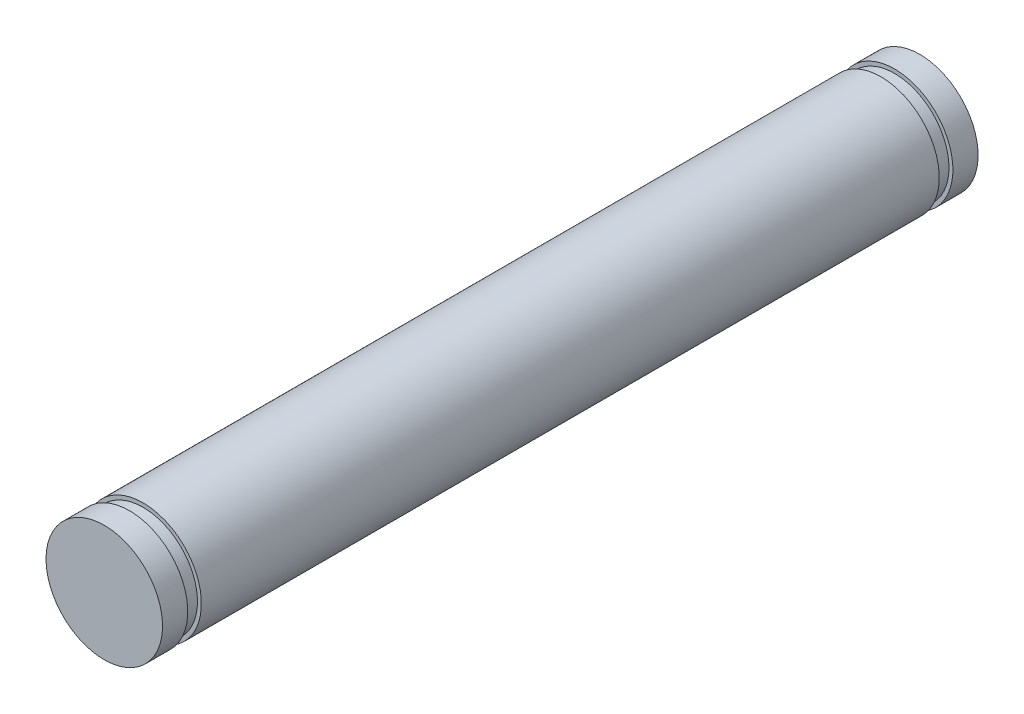
ISO-10303-21;
HEADER;
FILE_DESCRIPTION(('STEP AP214'),'2;1');
FILE_NAME('part.step','',(''),(''),'','','');
FILE_SCHEMA(('AUTOMOTIVE_DESIGN { 1 0 10303 214 1 1 1 1 }'));
ENDSEC;
DATA;
#1=APPLICATION_CONTEXT('core data for automotive mechanical design processes');
#2=APPLICATION_PROTOCOL_DEFINITION('international standard','automotive_design',2000,#1);
#3=PRODUCT_CONTEXT('',#1,'mechanical');
#4=PRODUCT('Part','Part','',(#3));
#5=PRODUCT_RELATED_PRODUCT_CATEGORY('part','',(#4));
#6=PRODUCT_DEFINITION_FORMATION('','',#4);
#7=PRODUCT_DEFINITION_CONTEXT('part definition',#1,'design');
#8=PRODUCT_DEFINITION('design','',#6,#7);
#9=PRODUCT_DEFINITION_SHAPE('','',#8);
#10=(LENGTH_UNIT() NAMED_UNIT(*) SI_UNIT(.MILLI.,.METRE.));
#11=(NAMED_UNIT(*) PLANE_ANGLE_UNIT() SI_UNIT($,.RADIAN.));
#12=(NAMED_UNIT(*) SI_UNIT($,.STERADIAN.) SOLID_ANGLE_UNIT());
#13=UNCERTAINTY_MEASURE_WITH_UNIT(LENGTH_MEASURE(1.E-05),#10,'distance_accuracy_value','');
#14=(GEOMETRIC_REPRESENTATION_CONTEXT(3) GLOBAL_UNCERTAINTY_ASSIGNED_CONTEXT((#13)) GLOBAL_UNIT_ASSIGNED_CONTEXT((#10,
#11,#12)) REPRESENTATION_CONTEXT('',''));
#15=CARTESIAN_POINT('',(0.,0.,0.));
#16=DIRECTION('',(0.,0.,1.));
#17=DIRECTION('',(1.,0.,0.));
#18=AXIS2_PLACEMENT_3D('',#15,#16,#17);
#19=CARTESIAN_POINT('',(0.,0.,42.));
#20=DIRECTION('',(0.,0.,1.));
#21=DIRECTION('',(1.,0.,0.));
#22=AXIS2_PLACEMENT_3D('',#19,#20,#21);
#23=PLANE('',#22);
#24=CARTESIAN_POINT('',(0.,0.,42.));
#25=DIRECTION('',(0.,0.,-1.));
#26=DIRECTION('',(-1.,0.,0.));
#27=AXIS2_PLACEMENT_3D('',#24,#25,#26);
#28=CIRCLE('',#27,3.);
#29=CARTESIAN_POINT('',(-3.,0.,42.));
#30=VERTEX_POINT('',#29);
#31=EDGE_CURVE('E18',#30,#30,#28,.T.);
#32=ORIENTED_EDGE('',*,*,#31,.F.);
#33=EDGE_LOOP('',(#32));
#34=FACE_BOUND('',#33,.T.);
#35=ADVANCED_FACE('F15',(#34),#23,.T.);
#36=CARTESIAN_POINT('',(0.,0.,0.));
#37=DIRECTION('',(0.,0.,1.));
#38=DIRECTION('',(1.,0.,0.));
#39=AXIS2_PLACEMENT_3D('',#36,#37,#38);
#40=PLANE('',#39);
#41=CARTESIAN_POINT('',(0.,0.,0.));
#42=DIRECTION('',(0.,0.,-1.));
#43=DIRECTION('',(-1.,0.,0.));
#44=AXIS2_PLACEMENT_3D('',#41,#42,#43);
#45=CIRCLE('',#44,3.);
#46=CARTESIAN_POINT('',(-3.,0.,0.));
#47=VERTEX_POINT('',#46);
#48=EDGE_CURVE('E46',#47,#47,#45,.F.);
#49=ORIENTED_EDGE('',*,*,#48,.F.);
#50=EDGE_LOOP('',(#49));
#51=FACE_BOUND('',#50,.T.);
#52=ADVANCED_FACE('F57',(#51),#40,.F.);
#53=CARTESIAN_POINT('',(0.,0.,42.));
#54=DIRECTION('',(0.,0.,-1.));
#55=DIRECTION('',(-1.,0.,0.));
#56=AXIS2_PLACEMENT_3D('',#53,#54,#55);
#57=CYLINDRICAL_SURFACE('',#56,3.);
#58=ORIENTED_EDGE('',*,*,#31,.T.);
#59=EDGE_LOOP('',(#58));
#60=FACE_BOUND('',#59,.T.);
#61=CARTESIAN_POINT('',(0.,0.,40.7));
#62=DIRECTION('',(0.,0.,-1.));
#63=DIRECTION('',(-1.,0.,0.));
#64=AXIS2_PLACEMENT_3D('',#61,#62,#63);
#65=CIRCLE('',#64,3.);
#66=CARTESIAN_POINT('',(-3.,0.,40.7));
#67=VERTEX_POINT('',#66);
#68=EDGE_CURVE('E44',#67,#67,#65,.T.);
#69=ORIENTED_EDGE('',*,*,#68,.F.);
#70=EDGE_LOOP('',(#69));
#71=FACE_BOUND('',#70,.T.);
#72=ADVANCED_FACE('F53',(#60,#71),#57,.T.);
#73=CARTESIAN_POINT('',(0.,0.,42.));
#74=DIRECTION('',(0.,0.,-1.));
#75=DIRECTION('',(-1.,0.,0.));
#76=AXIS2_PLACEMENT_3D('',#73,#74,#75);
#77=CYLINDRICAL_SURFACE('',#76,3.);
#78=CARTESIAN_POINT('',(0.,0.,1.3));
#79=DIRECTION('',(0.,0.,-1.));
#80=DIRECTION('',(-1.,0.,0.));
#81=AXIS2_PLACEMENT_3D('',#78,#79,#80);
#82=CIRCLE('',#81,3.);
#83=CARTESIAN_POINT('',(-3.,0.,1.3));
#84=VERTEX_POINT('',#83);
#85=EDGE_CURVE('E41',#84,#84,#82,.F.);
#86=ORIENTED_EDGE('',*,*,#85,.F.);
#87=EDGE_LOOP('',(#86));
#88=FACE_BOUND('',#87,.T.);
#89=ORIENTED_EDGE('',*,*,#48,.T.);
#90=EDGE_LOOP('',(#89));
#91=FACE_BOUND('',#90,.T.);
#92=ADVANCED_FACE('F93',(#88,#91),#77,.T.);
#93=CARTESIAN_POINT('',(3.,0.,40.7));
#94=DIRECTION('',(0.,0.,-1.));
#95=DIRECTION('',(-1.,0.,0.));
#96=AXIS2_PLACEMENT_3D('',#93,#94,#95);
#97=PLANE('',#96);
#98=CARTESIAN_POINT('',(0.,0.,40.7));
#99=DIRECTION('',(0.,0.,-1.));
#100=DIRECTION('',(-1.,0.,0.));
#101=AXIS2_PLACEMENT_3D('',#98,#99,#100);
#102=CIRCLE('',#101,2.8);
#103=CARTESIAN_POINT('',(-2.8,0.,40.7));
#104=VERTEX_POINT('',#103);
#105=EDGE_CURVE('E38',#104,#104,#102,.T.);
#106=ORIENTED_EDGE('',*,*,#105,.F.);
#107=EDGE_LOOP('',(#106));
#108=FACE_BOUND('',#107,.T.);
#109=ORIENTED_EDGE('',*,*,#68,.T.);
#110=EDGE_LOOP('',(#109));
#111=FACE_BOUND('',#110,.T.);
#112=ADVANCED_FACE('F89',(#108,#111),#97,.T.);
#113=CARTESIAN_POINT('',(3.,0.,1.3));
#114=DIRECTION('',(0.,0.,1.));
#115=DIRECTION('',(1.,0.,0.));
#116=AXIS2_PLACEMENT_3D('',#113,#114,#115);
#117=PLANE('',#116);
#118=ORIENTED_EDGE('',*,*,#85,.T.);
#119=EDGE_LOOP('',(#118));
#120=FACE_BOUND('',#119,.T.);
#121=CARTESIAN_POINT('',(0.,0.,1.3));
#122=DIRECTION('',(0.,0.,-1.));
#123=DIRECTION('',(-1.,0.,0.));
#124=AXIS2_PLACEMENT_3D('',#121,#122,#123);
#125=CIRCLE('',#124,2.8);
#126=CARTESIAN_POINT('',(-2.8,0.,1.3));
#127=VERTEX_POINT('',#126);
#128=EDGE_CURVE('E35',#127,#127,#125,.F.);
#129=ORIENTED_EDGE('',*,*,#128,.F.);
#130=EDGE_LOOP('',(#129));
#131=FACE_BOUND('',#130,.T.);
#132=ADVANCED_FACE('F85',(#120,#131),#117,.T.);
#133=CARTESIAN_POINT('',(0.,0.,0.));
#134=DIRECTION('',(0.,0.,-1.));
#135=DIRECTION('',(-1.,0.,0.));
#136=AXIS2_PLACEMENT_3D('',#133,#134,#135);
#137=CYLINDRICAL_SURFACE('',#136,2.8);
#138=ORIENTED_EDGE('',*,*,#105,.T.);
#139=EDGE_LOOP('',(#138));
#140=FACE_BOUND('',#139,.T.);
#141=CARTESIAN_POINT('',(0.,0.,40.));
#142=DIRECTION('',(0.,0.,-1.));
#143=DIRECTION('',(-1.,0.,0.));
#144=AXIS2_PLACEMENT_3D('',#141,#142,#143);
#145=CIRCLE('',#144,2.8);
#146=CARTESIAN_POINT('',(-2.8,0.,40.));
#147=VERTEX_POINT('',#146);
#148=EDGE_CURVE('E32',#147,#147,#145,.T.);
#149=ORIENTED_EDGE('',*,*,#148,.F.);
#150=EDGE_LOOP('',(#149));
#151=FACE_BOUND('',#150,.T.);
#152=ADVANCED_FACE('F81',(#140,#151),#137,.T.);
#153=CARTESIAN_POINT('',(0.,0.,0.));
#154=DIRECTION('',(0.,0.,-1.));
#155=DIRECTION('',(-1.,0.,0.));
#156=AXIS2_PLACEMENT_3D('',#153,#154,#155);
#157=CYLINDRICAL_SURFACE('',#156,2.8);
#158=CARTESIAN_POINT('',(0.,0.,2.));
#159=DIRECTION('',(0.,0.,-1.));
#160=DIRECTION('',(-1.,0.,0.));
#161=AXIS2_PLACEMENT_3D('',#158,#159,#160);
#162=CIRCLE('',#161,2.8);
#163=CARTESIAN_POINT('',(-2.8,0.,2.));
#164=VERTEX_POINT('',#163);
#165=EDGE_CURVE('E27',#164,#164,#162,.F.);
#166=ORIENTED_EDGE('',*,*,#165,.F.);
#167=EDGE_LOOP('',(#166));
#168=FACE_BOUND('',#167,.T.);
#169=ORIENTED_EDGE('',*,*,#128,.T.);
#170=EDGE_LOOP('',(#169));
#171=FACE_BOUND('',#170,.T.);
#172=ADVANCED_FACE('F77',(#168,#171),#157,.T.);
#173=CARTESIAN_POINT('',(3.,0.,40.));
#174=DIRECTION('',(0.,0.,1.));
#175=DIRECTION('',(1.,0.,0.));
#176=AXIS2_PLACEMENT_3D('',#173,#174,#175);
#177=PLANE('',#176);
#178=CARTESIAN_POINT('',(0.,0.,40.));
#179=DIRECTION('',(0.,0.,-1.));
#180=DIRECTION('',(-1.,0.,0.));
#181=AXIS2_PLACEMENT_3D('',#178,#179,#180);
#182=CIRCLE('',#181,3.);
#183=CARTESIAN_POINT('',(-3.,0.,40.));
#184=VERTEX_POINT('',#183);
#185=EDGE_CURVE('E22',#184,#184,#182,.T.);
#186=ORIENTED_EDGE('',*,*,#185,.F.);
#187=EDGE_LOOP('',(#186));
#188=FACE_BOUND('',#187,.T.);
#189=ORIENTED_EDGE('',*,*,#148,.T.);
#190=EDGE_LOOP('',(#189));
#191=FACE_BOUND('',#190,.T.);
#192=ADVANCED_FACE('F70',(#188,#191),#177,.T.);
#193=CARTESIAN_POINT('',(3.,0.,2.));
#194=DIRECTION('',(0.,0.,-1.));
#195=DIRECTION('',(-1.,0.,0.));
#196=AXIS2_PLACEMENT_3D('',#193,#194,#195);
#197=PLANE('',#196);
#198=ORIENTED_EDGE('',*,*,#165,.T.);
#199=EDGE_LOOP('',(#198));
#200=FACE_BOUND('',#199,.T.);
#201=CARTESIAN_POINT('',(0.,0.,2.));
#202=DIRECTION('',(0.,0.,-1.));
#203=DIRECTION('',(-1.,0.,0.));
#204=AXIS2_PLACEMENT_3D('',#201,#202,#203);
#205=CIRCLE('',#204,3.);
#206=CARTESIAN_POINT('',(-3.,0.,2.));
#207=VERTEX_POINT('',#206);
#208=EDGE_CURVE('E10',#207,#207,#205,.F.);
#209=ORIENTED_EDGE('',*,*,#208,.F.);
#210=EDGE_LOOP('',(#209));
#211=FACE_BOUND('',#210,.T.);
#212=ADVANCED_FACE('F65',(#200,#211),#197,.T.);
#213=CARTESIAN_POINT('',(0.,0.,42.));
#214=DIRECTION('',(0.,0.,-1.));
#215=DIRECTION('',(-1.,0.,0.));
#216=AXIS2_PLACEMENT_3D('',#213,#214,#215);
#217=CYLINDRICAL_SURFACE('',#216,3.);
#218=ORIENTED_EDGE('',*,*,#208,.T.);
#219=EDGE_LOOP('',(#218));
#220=FACE_BOUND('',#219,.T.);
#221=ORIENTED_EDGE('',*,*,#185,.T.);
#222=EDGE_LOOP('',(#221));
#223=FACE_BOUND('',#222,.T.);
#224=ADVANCED_FACE('F63',(#220,#223),#217,.T.);
#225=CLOSED_SHELL('',(#35,#52,#72,#92,#112,#132,#152,#172,#192,#212,#224));
#226=MANIFOLD_SOLID_BREP('B1',#225);
#227=ADVANCED_BREP_SHAPE_REPRESENTATION('',(#18,#226),#14);
#228=SHAPE_DEFINITION_REPRESENTATION(#9,#227);
ENDSEC;
END-ISO-10303-21;
